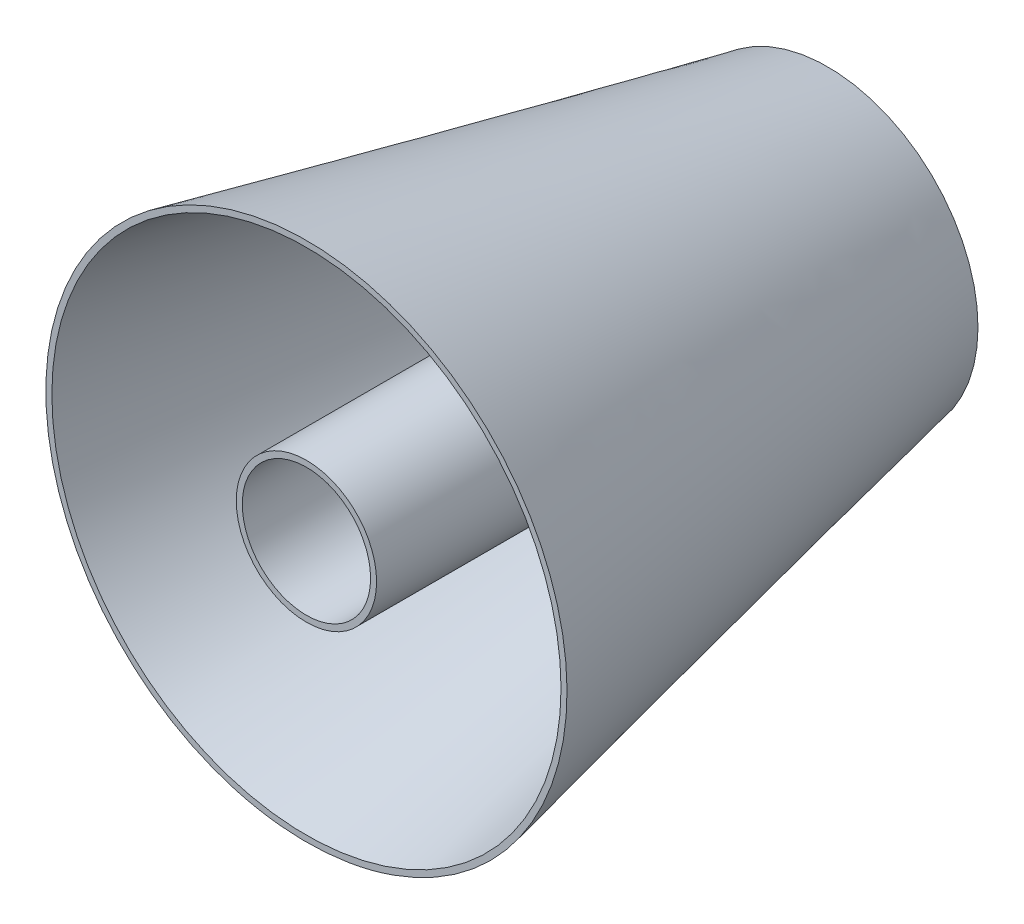
ISO-10303-21;
HEADER;
FILE_DESCRIPTION(('STEP AP214'),'2;1');
FILE_NAME('part.step','',(''),(''),'','','');
FILE_SCHEMA(('AUTOMOTIVE_DESIGN { 1 0 10303 214 1 1 1 1 }'));
ENDSEC;
DATA;
#1=APPLICATION_CONTEXT('core data for automotive mechanical design processes');
#2=APPLICATION_PROTOCOL_DEFINITION('international standard','automotive_design',2000,#1);
#3=PRODUCT_CONTEXT('',#1,'mechanical');
#4=PRODUCT('Part','Part','',(#3));
#5=PRODUCT_RELATED_PRODUCT_CATEGORY('part','',(#4));
#6=PRODUCT_DEFINITION_FORMATION('','',#4);
#7=PRODUCT_DEFINITION_CONTEXT('part definition',#1,'design');
#8=PRODUCT_DEFINITION('design','',#6,#7);
#9=PRODUCT_DEFINITION_SHAPE('','',#8);
#10=(LENGTH_UNIT() NAMED_UNIT(*) SI_UNIT(.MILLI.,.METRE.));
#11=(NAMED_UNIT(*) PLANE_ANGLE_UNIT() SI_UNIT($,.RADIAN.));
#12=(NAMED_UNIT(*) SI_UNIT($,.STERADIAN.) SOLID_ANGLE_UNIT());
#13=UNCERTAINTY_MEASURE_WITH_UNIT(LENGTH_MEASURE(1.E-05),#10,'distance_accuracy_value','');
#14=(GEOMETRIC_REPRESENTATION_CONTEXT(3) GLOBAL_UNCERTAINTY_ASSIGNED_CONTEXT((#13)) GLOBAL_UNIT_ASSIGNED_CONTEXT((#10,
#11,#12)) REPRESENTATION_CONTEXT('',''));
#15=CARTESIAN_POINT('',(0.,0.,0.));
#16=DIRECTION('',(0.,0.,1.));
#17=DIRECTION('',(1.,0.,0.));
#18=AXIS2_PLACEMENT_3D('',#15,#16,#17);
#19=CARTESIAN_POINT('',(0.,0.,3.));
#20=DIRECTION('',(0.,0.,-1.));
#21=DIRECTION('',(-1.,0.,0.));
#22=AXIS2_PLACEMENT_3D('',#19,#20,#21);
#23=PLANE('',#22);
#24=CARTESIAN_POINT('',(0.,0.,3.));
#25=DIRECTION('',(0.,0.,-1.));
#26=DIRECTION('',(-1.,0.,0.));
#27=AXIS2_PLACEMENT_3D('',#24,#25,#26);
#28=CIRCLE('',#27,72.6346153846154);
#29=CARTESIAN_POINT('',(-72.6346153846154,0.,3.));
#30=VERTEX_POINT('',#29);
#31=EDGE_CURVE('E45',#30,#30,#28,.F.);
#32=ORIENTED_EDGE('',*,*,#31,.T.);
#33=EDGE_LOOP('',(#32));
#34=FACE_BOUND('',#33,.T.);
#35=CARTESIAN_POINT('',(0.,0.,3.));
#36=DIRECTION('',(0.,0.,-1.));
#37=DIRECTION('',(-1.,0.,0.));
#38=AXIS2_PLACEMENT_3D('',#35,#36,#37);
#39=CIRCLE('',#38,35.);
#40=CARTESIAN_POINT('',(-35.,0.,3.));
#41=VERTEX_POINT('',#40);
#42=EDGE_CURVE('E11',#41,#41,#39,.F.);
#43=ORIENTED_EDGE('',*,*,#42,.F.);
#44=EDGE_LOOP('',(#43));
#45=FACE_BOUND('',#44,.T.);
#46=ADVANCED_FACE('F37',(#34,#45),#23,.F.);
#47=CARTESIAN_POINT('',(0.,0.,0.));
#48=DIRECTION('',(0.,0.,1.));
#49=DIRECTION('',(1.,0.,0.));
#50=AXIS2_PLACEMENT_3D('',#47,#48,#49);
#51=CONICAL_SURFACE('',#50,72.,0.208465218379988);
#52=CARTESIAN_POINT('',(0.,0.,260.));
#53=DIRECTION('',(0.,0.,1.));
#54=DIRECTION('',(1.,0.,0.));
#55=AXIS2_PLACEMENT_3D('',#52,#53,#54);
#56=CIRCLE('',#55,127.);
#57=CARTESIAN_POINT('',(127.,0.,260.));
#58=VERTEX_POINT('',#57);
#59=EDGE_CURVE('E60',#58,#58,#56,.T.);
#60=ORIENTED_EDGE('',*,*,#59,.T.);
#61=EDGE_LOOP('',(#60));
#62=FACE_BOUND('',#61,.T.);
#63=ORIENTED_EDGE('',*,*,#31,.F.);
#64=EDGE_LOOP('',(#63));
#65=FACE_BOUND('',#64,.T.);
#66=ADVANCED_FACE('F90',(#62,#65),#51,.F.);
#67=CARTESIAN_POINT('',(0.,0.,0.));
#68=DIRECTION('',(0.,0.,1.));
#69=DIRECTION('',(1.,0.,0.));
#70=AXIS2_PLACEMENT_3D('',#67,#68,#69);
#71=PLANE('',#70);
#72=CARTESIAN_POINT('',(0.,0.,0.));
#73=DIRECTION('',(0.,0.,1.));
#74=DIRECTION('',(1.,0.,0.));
#75=AXIS2_PLACEMENT_3D('',#72,#73,#74);
#76=CIRCLE('',#75,75.);
#77=CARTESIAN_POINT('',(13.3586467698157,73.8007219238355,0.));
#78=VERTEX_POINT('',#77);
#79=EDGE_CURVE('E53',#78,#78,#76,.T.);
#80=ORIENTED_EDGE('',*,*,#79,.F.);
#81=EDGE_LOOP('',(#80));
#82=FACE_BOUND('',#81,.T.);
#83=ADVANCED_FACE('F39',(#82),#71,.F.);
#84=CARTESIAN_POINT('',(0.,0.,260.));
#85=DIRECTION('',(0.,0.,1.));
#86=DIRECTION('',(1.,0.,0.));
#87=AXIS2_PLACEMENT_3D('',#84,#85,#86);
#88=PLANE('',#87);
#89=ORIENTED_EDGE('',*,*,#59,.F.);
#90=EDGE_LOOP('',(#89));
#91=FACE_BOUND('',#90,.T.);
#92=CARTESIAN_POINT('',(0.,0.,260.));
#93=DIRECTION('',(0.,0.,1.));
#94=DIRECTION('',(1.,0.,0.));
#95=AXIS2_PLACEMENT_3D('',#92,#93,#94);
#96=CIRCLE('',#95,130.);
#97=CARTESIAN_POINT('',(-3.83846825847501,129.943319033449,260.));
#98=VERTEX_POINT('',#97);
#99=EDGE_CURVE('E49',#98,#98,#96,.T.);
#100=ORIENTED_EDGE('',*,*,#99,.T.);
#101=EDGE_LOOP('',(#100));
#102=FACE_BOUND('',#101,.T.);
#103=ADVANCED_FACE('F79',(#91,#102),#88,.T.);
#104=CARTESIAN_POINT('',(-3.83846825847501,129.943319033449,260.));
#105=CARTESIAN_POINT('',(13.3586467698157,73.8007219238355,0.));
#106=CARTESIAN_POINT('',(256.048169808423,137.620255550399,260.));
#107=CARTESIAN_POINT('',(160.960090617487,47.083428384204,0.));
#108=CARTESIAN_POINT('',(263.725106325373,-122.266382516499,260.));
#109=CARTESIAN_POINT('',(134.242797077855,-100.518015463467,0.));
#110=CARTESIAN_POINT('',(3.838468258475,-129.943319033449,260.));
#111=CARTESIAN_POINT('',(-13.3586467698157,-73.8007219238355,0.));
#112=CARTESIAN_POINT('',(-256.048169808423,-137.620255550399,260.));
#113=CARTESIAN_POINT('',(-160.960090617487,-47.083428384204,0.));
#114=CARTESIAN_POINT('',(-263.725106325373,122.266382516499,260.));
#115=CARTESIAN_POINT('',(-134.242797077855,100.518015463467,0.));
#116=CARTESIAN_POINT('',(-3.83846825847501,129.943319033449,260.));
#117=CARTESIAN_POINT('',(13.3586467698157,73.8007219238355,0.));
#118=(BOUNDED_SURFACE() B_SPLINE_SURFACE(3,1,((#104,#105),(#106,#107),(#108,#109),(#110,#111),
(#112,#113),(#114,#115),(#116,#117)),.UNSPECIFIED.,.T.,.F.,.F.) B_SPLINE_SURFACE_WITH_KNOTS((4,
3,4),(2,2),(0.,0.5,1.),(0.,1.),
.UNSPECIFIED.) GEOMETRIC_REPRESENTATION_ITEM() RATIONAL_B_SPLINE_SURFACE(((1.,1.),
(0.333333333333333,0.333333333333333),(0.333333333333333,0.333333333333333),(1.,1.),
(0.333333333333333,0.333333333333333),(0.333333333333333,0.333333333333333),(1.,1.))) REPRESENTATION_ITEM('') SURFACE());
#119=CARTESIAN_POINT('',(-3.83846825847501,129.943319033449,260.));
#120=CARTESIAN_POINT('',(-3.65933164359699,129.358500313557,257.291666666667));
#121=CARTESIAN_POINT('',(-3.48019502871896,128.773681593665,254.583333333333));
#122=CARTESIAN_POINT('',(-3.1219217989629,127.604044153882,249.166666666667));
#123=CARTESIAN_POINT('',(-2.94278518408487,127.01922543399,246.458333333333));
#124=CARTESIAN_POINT('',(-2.58451195432881,125.849587994206,241.041666666667));
#125=CARTESIAN_POINT('',(-2.40537533945079,125.264769274314,238.333333333333));
#126=CARTESIAN_POINT('',(-2.04710210969473,124.095131834531,232.916666666667));
#127=CARTESIAN_POINT('',(-1.8679654948167,123.510313114639,230.208333333333));
#128=CARTESIAN_POINT('',(-1.50969226506064,122.340675674855,224.791666666667));
#129=CARTESIAN_POINT('',(-1.33055565018261,121.755856954964,222.083333333333));
#130=CARTESIAN_POINT('',(-0.972282420426557,120.58621951518,216.666666666667));
#131=CARTESIAN_POINT('',(-0.793145805548528,120.001400795288,213.958333333333));
#132=CARTESIAN_POINT('',(-0.434872575792471,118.831763355505,208.541666666667));
#133=CARTESIAN_POINT('',(-0.255735960914442,118.246944635613,205.833333333333));
#134=CARTESIAN_POINT('',(0.102537268841615,117.077307195829,200.416666666667));
#135=CARTESIAN_POINT('',(0.281673883719643,116.492488475937,197.708333333333));
#136=CARTESIAN_POINT('',(0.6399471134757,115.322851036154,192.291666666667));
#137=CARTESIAN_POINT('',(0.819083728353729,114.738032316262,189.583333333333));
#138=CARTESIAN_POINT('',(1.17735695810979,113.568394876478,184.166666666667));
#139=CARTESIAN_POINT('',(1.35649357298781,112.983576156587,181.458333333333));
#140=CARTESIAN_POINT('',(1.71476680274387,111.813938716803,176.041666666667));
#141=CARTESIAN_POINT('',(1.8939034176219,111.229119996911,173.333333333333));
#142=CARTESIAN_POINT('',(2.25217664737796,110.059482557127,167.916666666667));
#143=CARTESIAN_POINT('',(2.43131326225599,109.474663837236,165.208333333333));
#144=CARTESIAN_POINT('',(2.78958649201204,108.305026397452,159.791666666667));
#145=CARTESIAN_POINT('',(2.96872310689007,107.72020767756,157.083333333333));
#146=CARTESIAN_POINT('',(3.32699633664613,106.550570237777,151.666666666667));
#147=CARTESIAN_POINT('',(3.50613295152416,105.965751517885,148.958333333333));
#148=CARTESIAN_POINT('',(3.86440618128021,104.796114078101,143.541666666667));
#149=CARTESIAN_POINT('',(4.04354279615824,104.211295358209,140.833333333333));
#150=CARTESIAN_POINT('',(4.4018160259143,103.041657918426,135.416666666667));
#151=CARTESIAN_POINT('',(4.58095264079233,102.456839198534,132.708333333333));
#152=CARTESIAN_POINT('',(4.93922587054839,101.28720175875,127.291666666667));
#153=CARTESIAN_POINT('',(5.11836248542642,100.702383038859,124.583333333333));
#154=CARTESIAN_POINT('',(5.47663571518247,99.5327455990749,119.166666666667));
#155=CARTESIAN_POINT('',(5.6557723300605,98.9479268791831,116.458333333333));
#156=CARTESIAN_POINT('',(6.01404555981656,97.7782894393995,111.041666666667));
#157=CARTESIAN_POINT('',(6.19318217469459,97.1934707195077,108.333333333333));
#158=CARTESIAN_POINT('',(6.55145540445064,96.0238332797241,102.916666666667));
#159=CARTESIAN_POINT('',(6.73059201932867,95.4390145598323,100.208333333333));
#160=CARTESIAN_POINT('',(7.08886524908473,94.2693771200487,94.7916666666667));
#161=CARTESIAN_POINT('',(7.26800186396276,93.6845584001569,92.0833333333333));
#162=CARTESIAN_POINT('',(7.62627509371882,92.5149209603733,86.6666666666667));
#163=CARTESIAN_POINT('',(7.80541170859684,91.9301022404815,83.9583333333333));
#164=CARTESIAN_POINT('',(8.1636849383529,90.7604648006979,78.5416666666667));
#165=CARTESIAN_POINT('',(8.34282155323093,90.1756460808061,75.8333333333333));
#166=CARTESIAN_POINT('',(8.70109478298699,89.0060086410225,70.4166666666667));
#167=CARTESIAN_POINT('',(8.88023139786502,88.4211899211306,67.7083333333333));
#168=CARTESIAN_POINT('',(9.23850462762107,87.251552481347,62.2916666666667));
#169=CARTESIAN_POINT('',(9.4176412424991,86.6667337614552,59.5833333333333));
#170=CARTESIAN_POINT('',(9.77591447225516,85.4970963216716,54.1666666666667));
#171=CARTESIAN_POINT('',(9.95505108713319,84.9122776017798,51.4583333333333));
#172=CARTESIAN_POINT('',(10.3133243168892,83.7426401619962,46.0416666666667));
#173=CARTESIAN_POINT('',(10.4924609317673,83.1578214421044,43.3333333333333));
#174=CARTESIAN_POINT('',(10.8507341615233,81.9881840023208,37.9166666666667));
#175=CARTESIAN_POINT('',(11.0298707764014,81.403365282429,35.2083333333333));
#176=CARTESIAN_POINT('',(11.3881440061574,80.2337278426454,29.7916666666667));
#177=CARTESIAN_POINT('',(11.5672806210354,79.6489091227536,27.0833333333333));
#178=CARTESIAN_POINT('',(11.9255538507915,78.47927168297,21.6666666666667));
#179=CARTESIAN_POINT('',(12.1046904656695,77.8944529630781,18.9583333333333));
#180=CARTESIAN_POINT('',(12.4629636954256,76.7248155232945,13.5416666666667));
#181=CARTESIAN_POINT('',(12.6421003103036,76.1399968034027,10.8333333333333));
#182=CARTESIAN_POINT('',(13.0003735400597,74.9703593636191,5.41666666666667));
#183=CARTESIAN_POINT('',(13.1795101549377,74.3855406437273,2.70833333333333));
#184=CARTESIAN_POINT('',(13.3586467698157,73.8007219238355,0.));
#185=B_SPLINE_CURVE_WITH_KNOTS('',3,(#119,#120,#121,#122,#123,#124,#125,#126,#127,#128,#129,
#130,#131,#132,#133,#134,#135,#136,#137,#138,#139,#140,#141,#142,#143,#144,#145,#146,#147,#148,
#149,#150,#151,#152,#153,#154,#155,#156,#157,#158,#159,#160,#161,#162,#163,#164,#165,#166,#167,
#168,#169,#170,#171,#172,#173,#174,#175,#176,#177,#178,#179,#180,#181,#182,#183,#184),
.UNSPECIFIED.,.F.,.F.,(4,2,2,2,2,2,2,2,2,2,2,2,2,2,2,2,2,2,2,2,2,2,2,2,2,2,2,2,2,2,2,2,4),(0.,
8.32961888427871,16.6592377685574,24.9888566528362,33.3184755371149,41.6480944213936,
49.9777133056723,58.307332189951,66.6369510742297,74.9665699585084,83.2961888427872,
91.6258077270659,99.9554266113446,108.285045495623,116.614664379902,124.944283264181,
133.27390214846,141.603521032738,149.933139917017,158.262758801296,166.592377685574,
174.921996569853,183.251615454132,191.581234338411,199.910853222689,208.240472106968,
216.570090991247,224.899709875525,233.229328759804,241.558947644083,249.888566528362,
258.21818541264,266.547804296919),.UNSPECIFIED.);
#186=EDGE_CURVE('BSEAM88',#98,#78,#185,.T.);
#187=ORIENTED_EDGE('',*,*,#99,.F.);
#188=ORIENTED_EDGE('',*,*,#79,.T.);
#189=ORIENTED_EDGE('',*,*,#186,.T.);
#190=ORIENTED_EDGE('',*,*,#186,.F.);
#191=EDGE_LOOP('',(#187,#189,#188,#190));
#192=FACE_BOUND('',#191,.T.);
#193=ADVANCED_FACE('F88',(#192),#118,.T.);
#194=CARTESIAN_POINT('',(0.,0.,260.));
#195=DIRECTION('',(0.,0.,1.));
#196=DIRECTION('',(1.,0.,0.));
#197=AXIS2_PLACEMENT_3D('',#194,#195,#196);
#198=PLANE('',#197);
#199=CARTESIAN_POINT('',(0.,0.,260.));
#200=DIRECTION('',(0.,0.,1.));
#201=DIRECTION('',(1.,0.,0.));
#202=AXIS2_PLACEMENT_3D('',#199,#200,#201);
#203=CIRCLE('',#202,35.);
#204=CARTESIAN_POINT('',(35.,0.,260.));
#205=VERTEX_POINT('',#204);
#206=EDGE_CURVE('E126',#205,#205,#203,.T.);
#207=ORIENTED_EDGE('',*,*,#206,.T.);
#208=EDGE_LOOP('',(#207));
#209=FACE_BOUND('',#208,.T.);
#210=CARTESIAN_POINT('',(0.,0.,260.));
#211=DIRECTION('',(0.,0.,1.));
#212=DIRECTION('',(1.,0.,0.));
#213=AXIS2_PLACEMENT_3D('',#210,#211,#212);
#214=CIRCLE('',#213,32.);
#215=CARTESIAN_POINT('',(32.,0.,260.));
#216=VERTEX_POINT('',#215);
#217=EDGE_CURVE('E129',#216,#216,#214,.T.);
#218=ORIENTED_EDGE('',*,*,#217,.F.);
#219=EDGE_LOOP('',(#218));
#220=FACE_BOUND('',#219,.T.);
#221=ADVANCED_FACE('F96',(#209,#220),#198,.T.);
#222=CARTESIAN_POINT('',(0.,0.,260.));
#223=DIRECTION('',(0.,0.,-1.));
#224=DIRECTION('',(-1.,0.,0.));
#225=AXIS2_PLACEMENT_3D('',#222,#223,#224);
#226=CYLINDRICAL_SURFACE('',#225,35.);
#227=ORIENTED_EDGE('',*,*,#206,.F.);
#228=EDGE_LOOP('',(#227));
#229=FACE_BOUND('',#228,.T.);
#230=ORIENTED_EDGE('',*,*,#42,.T.);
#231=EDGE_LOOP('',(#230));
#232=FACE_BOUND('',#231,.T.);
#233=ADVANCED_FACE('F140',(#229,#232),#226,.T.);
#234=CARTESIAN_POINT('',(0.,0.,260.));
#235=DIRECTION('',(0.,0.,-1.));
#236=DIRECTION('',(-1.,0.,0.));
#237=AXIS2_PLACEMENT_3D('',#234,#235,#236);
#238=CYLINDRICAL_SURFACE('',#237,32.);
#239=ORIENTED_EDGE('',*,*,#217,.T.);
#240=EDGE_LOOP('',(#239));
#241=FACE_BOUND('',#240,.T.);
#242=CARTESIAN_POINT('',(0.,0.,3.));
#243=DIRECTION('',(0.,0.,1.));
#244=DIRECTION('',(1.,0.,0.));
#245=AXIS2_PLACEMENT_3D('',#242,#243,#244);
#246=CIRCLE('',#245,32.);
#247=CARTESIAN_POINT('',(32.,0.,3.));
#248=VERTEX_POINT('',#247);
#249=EDGE_CURVE('E130',#248,#248,#246,.T.);
#250=ORIENTED_EDGE('',*,*,#249,.F.);
#251=EDGE_LOOP('',(#250));
#252=FACE_BOUND('',#251,.T.);
#253=ADVANCED_FACE('F136',(#241,#252),#238,.F.);
#254=ORIENTED_EDGE('',*,*,#249,.T.);
#255=EDGE_LOOP('',(#254));
#256=FACE_BOUND('',#255,.T.);
#257=ADVANCED_FACE('F150',(#256),#23,.F.);
#258=CLOSED_SHELL('',(#46,#66,#83,#103,#193,#221,#233,#253,#257));
#259=MANIFOLD_SOLID_BREP('B2',#258);
#260=ADVANCED_BREP_SHAPE_REPRESENTATION('',(#18,#259),#14);
#261=SHAPE_DEFINITION_REPRESENTATION(#9,#260);
ENDSEC;
END-ISO-10303-21;
